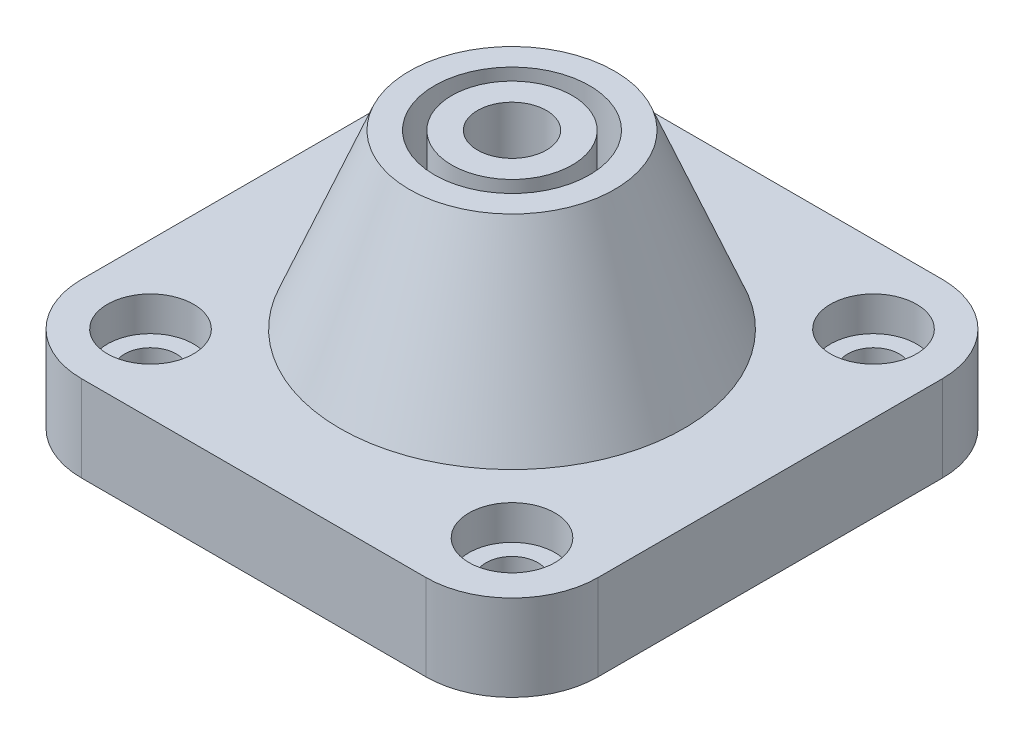
ISO-10303-21;
HEADER;
FILE_DESCRIPTION(('STEP AP214'),'2;1');
FILE_NAME('part.step','',(''),(''),'','','');
FILE_SCHEMA(('AUTOMOTIVE_DESIGN { 1 0 10303 214 1 1 1 1 }'));
ENDSEC;
DATA;
#1=APPLICATION_CONTEXT('core data for automotive mechanical design processes');
#2=APPLICATION_PROTOCOL_DEFINITION('international standard','automotive_design',2000,#1);
#3=PRODUCT_CONTEXT('',#1,'mechanical');
#4=PRODUCT('Part','Part','',(#3));
#5=PRODUCT_RELATED_PRODUCT_CATEGORY('part','',(#4));
#6=PRODUCT_DEFINITION_FORMATION('','',#4);
#7=PRODUCT_DEFINITION_CONTEXT('part definition',#1,'design');
#8=PRODUCT_DEFINITION('design','',#6,#7);
#9=PRODUCT_DEFINITION_SHAPE('','',#8);
#10=(LENGTH_UNIT() NAMED_UNIT(*) SI_UNIT(.MILLI.,.METRE.));
#11=(NAMED_UNIT(*) PLANE_ANGLE_UNIT() SI_UNIT($,.RADIAN.));
#12=(NAMED_UNIT(*) SI_UNIT($,.STERADIAN.) SOLID_ANGLE_UNIT());
#13=UNCERTAINTY_MEASURE_WITH_UNIT(LENGTH_MEASURE(1.E-05),#10,'distance_accuracy_value','');
#14=(GEOMETRIC_REPRESENTATION_CONTEXT(3) GLOBAL_UNCERTAINTY_ASSIGNED_CONTEXT((#13)) GLOBAL_UNIT_ASSIGNED_CONTEXT((#10,
#11,#12)) REPRESENTATION_CONTEXT('',''));
#15=CARTESIAN_POINT('',(0.,0.,0.));
#16=DIRECTION('',(0.,0.,1.));
#17=DIRECTION('',(1.,0.,0.));
#18=AXIS2_PLACEMENT_3D('',#15,#16,#17);
#19=CARTESIAN_POINT('',(10.5,0.,-10.5));
#20=DIRECTION('',(0.,1.,0.));
#21=DIRECTION('',(0.,0.,1.));
#22=AXIS2_PLACEMENT_3D('',#19,#20,#21);
#23=CYLINDRICAL_SURFACE('',#22,1.5);
#24=CARTESIAN_POINT('',(10.5,0.,-10.5));
#25=DIRECTION('',(0.,1.,0.));
#26=DIRECTION('',(0.,0.,1.));
#27=AXIS2_PLACEMENT_3D('',#24,#25,#26);
#28=CIRCLE('',#27,1.5);
#29=CARTESIAN_POINT('',(10.5,0.,-8.99999999999995));
#30=VERTEX_POINT('',#29);
#31=EDGE_CURVE('E306',#30,#30,#28,.T.);
#32=ORIENTED_EDGE('',*,*,#31,.F.);
#33=EDGE_LOOP('',(#32));
#34=FACE_BOUND('',#33,.T.);
#35=CARTESIAN_POINT('',(10.5,3.,-10.5));
#36=DIRECTION('',(0.,1.,0.));
#37=DIRECTION('',(0.,0.,1.));
#38=AXIS2_PLACEMENT_3D('',#35,#36,#37);
#39=CIRCLE('',#38,1.5);
#40=CARTESIAN_POINT('',(10.5,3.,-8.99999999999995));
#41=VERTEX_POINT('',#40);
#42=EDGE_CURVE('E155',#41,#41,#39,.F.);
#43=ORIENTED_EDGE('',*,*,#42,.F.);
#44=EDGE_LOOP('',(#43));
#45=FACE_BOUND('',#44,.T.);
#46=ADVANCED_FACE('F36',(#34,#45),#23,.F.);
#47=CARTESIAN_POINT('',(10.5,0.,10.5));
#48=DIRECTION('',(0.,1.,0.));
#49=DIRECTION('',(0.,0.,1.));
#50=AXIS2_PLACEMENT_3D('',#47,#48,#49);
#51=CYLINDRICAL_SURFACE('',#50,1.5);
#52=CARTESIAN_POINT('',(10.5,0.,10.5));
#53=DIRECTION('',(0.,1.,0.));
#54=DIRECTION('',(0.,0.,1.));
#55=AXIS2_PLACEMENT_3D('',#52,#53,#54);
#56=CIRCLE('',#55,1.5);
#57=CARTESIAN_POINT('',(10.5,0.,12.));
#58=VERTEX_POINT('',#57);
#59=EDGE_CURVE('E310',#58,#58,#56,.T.);
#60=ORIENTED_EDGE('',*,*,#59,.F.);
#61=EDGE_LOOP('',(#60));
#62=FACE_BOUND('',#61,.T.);
#63=CARTESIAN_POINT('',(10.5,3.,10.5));
#64=DIRECTION('',(0.,1.,0.));
#65=DIRECTION('',(0.,0.,1.));
#66=AXIS2_PLACEMENT_3D('',#63,#64,#65);
#67=CIRCLE('',#66,1.5);
#68=CARTESIAN_POINT('',(10.5,3.,12.));
#69=VERTEX_POINT('',#68);
#70=EDGE_CURVE('E152',#69,#69,#67,.F.);
#71=ORIENTED_EDGE('',*,*,#70,.F.);
#72=EDGE_LOOP('',(#71));
#73=FACE_BOUND('',#72,.T.);
#74=ADVANCED_FACE('F197',(#62,#73),#51,.F.);
#75=CARTESIAN_POINT('',(-10.5,0.,10.5));
#76=DIRECTION('',(0.,1.,0.));
#77=DIRECTION('',(0.,0.,1.));
#78=AXIS2_PLACEMENT_3D('',#75,#76,#77);
#79=CYLINDRICAL_SURFACE('',#78,1.5);
#80=CARTESIAN_POINT('',(-10.5,0.,10.5));
#81=DIRECTION('',(0.,1.,0.));
#82=DIRECTION('',(0.,0.,1.));
#83=AXIS2_PLACEMENT_3D('',#80,#81,#82);
#84=CIRCLE('',#83,1.5);
#85=CARTESIAN_POINT('',(-10.5,0.,12.));
#86=VERTEX_POINT('',#85);
#87=EDGE_CURVE('E313',#86,#86,#84,.T.);
#88=ORIENTED_EDGE('',*,*,#87,.F.);
#89=EDGE_LOOP('',(#88));
#90=FACE_BOUND('',#89,.T.);
#91=CARTESIAN_POINT('',(-10.5,3.,10.5));
#92=DIRECTION('',(0.,1.,0.));
#93=DIRECTION('',(0.,0.,1.));
#94=AXIS2_PLACEMENT_3D('',#91,#92,#93);
#95=CIRCLE('',#94,1.5);
#96=CARTESIAN_POINT('',(-10.5,3.,12.));
#97=VERTEX_POINT('',#96);
#98=EDGE_CURVE('E148',#97,#97,#95,.F.);
#99=ORIENTED_EDGE('',*,*,#98,.F.);
#100=EDGE_LOOP('',(#99));
#101=FACE_BOUND('',#100,.T.);
#102=ADVANCED_FACE('F203',(#90,#101),#79,.F.);
#103=CARTESIAN_POINT('',(-10.5,0.,-10.5));
#104=DIRECTION('',(0.,1.,0.));
#105=DIRECTION('',(0.,0.,1.));
#106=AXIS2_PLACEMENT_3D('',#103,#104,#105);
#107=CYLINDRICAL_SURFACE('',#106,1.5);
#108=CARTESIAN_POINT('',(-10.5,0.,-10.5));
#109=DIRECTION('',(0.,1.,0.));
#110=DIRECTION('',(0.,0.,1.));
#111=AXIS2_PLACEMENT_3D('',#108,#109,#110);
#112=CIRCLE('',#111,1.5);
#113=CARTESIAN_POINT('',(-10.5,0.,-8.99999999999995));
#114=VERTEX_POINT('',#113);
#115=EDGE_CURVE('E158',#114,#114,#112,.T.);
#116=ORIENTED_EDGE('',*,*,#115,.F.);
#117=EDGE_LOOP('',(#116));
#118=FACE_BOUND('',#117,.T.);
#119=CARTESIAN_POINT('',(-10.5,3.,-10.5));
#120=DIRECTION('',(0.,1.,0.));
#121=DIRECTION('',(0.,0.,1.));
#122=AXIS2_PLACEMENT_3D('',#119,#120,#121);
#123=CIRCLE('',#122,1.5);
#124=CARTESIAN_POINT('',(-10.5,3.,-8.99999999999995));
#125=VERTEX_POINT('',#124);
#126=EDGE_CURVE('E145',#125,#125,#123,.F.);
#127=ORIENTED_EDGE('',*,*,#126,.F.);
#128=EDGE_LOOP('',(#127));
#129=FACE_BOUND('',#128,.T.);
#130=ADVANCED_FACE('F210',(#118,#129),#107,.F.);
#131=CARTESIAN_POINT('',(0.,15.,0.));
#132=DIRECTION('',(0.,1.,0.));
#133=DIRECTION('',(0.,0.,1.));
#134=AXIS2_PLACEMENT_3D('',#131,#132,#133);
#135=PLANE('',#134);
#136=CARTESIAN_POINT('',(0.,15.,0.));
#137=DIRECTION('',(0.,1.,0.));
#138=DIRECTION('',(0.,0.,1.));
#139=AXIS2_PLACEMENT_3D('',#136,#137,#138);
#140=CIRCLE('',#139,2.);
#141=CARTESIAN_POINT('',(0.,15.,2.));
#142=VERTEX_POINT('',#141);
#143=EDGE_CURVE('E137',#142,#142,#140,.T.);
#144=ORIENTED_EDGE('',*,*,#143,.F.);
#145=EDGE_LOOP('',(#144));
#146=FACE_BOUND('',#145,.T.);
#147=CARTESIAN_POINT('',(0.,15.,0.));
#148=DIRECTION('',(0.,1.,0.));
#149=DIRECTION('',(0.,0.,1.));
#150=AXIS2_PLACEMENT_3D('',#147,#148,#149);
#151=CIRCLE('',#150,3.5);
#152=CARTESIAN_POINT('',(0.,15.,3.5));
#153=VERTEX_POINT('',#152);
#154=EDGE_CURVE('E302',#153,#153,#151,.T.);
#155=ORIENTED_EDGE('',*,*,#154,.T.);
#156=EDGE_LOOP('',(#155));
#157=FACE_BOUND('',#156,.T.);
#158=ADVANCED_FACE('F233',(#146,#157),#135,.T.);
#159=CARTESIAN_POINT('',(15.,5.,15.));
#160=DIRECTION('',(-1.,0.,0.));
#161=DIRECTION('',(0.,0.,1.));
#162=AXIS2_PLACEMENT_3D('',#159,#160,#161);
#163=PLANE('',#162);
#164=DIRECTION('',(0.,0.,-1.));
#165=VECTOR('',#164,1.);
#166=CARTESIAN_POINT('',(15.,0.,15.));
#167=LINE('',#166,#165);
#168=CARTESIAN_POINT('',(15.,0.,10.));
#169=VERTEX_POINT('',#168);
#170=CARTESIAN_POINT('',(15.,0.,-10.));
#171=VERTEX_POINT('',#170);
#172=EDGE_CURVE('E133',#169,#171,#167,.T.);
#173=ORIENTED_EDGE('',*,*,#172,.T.);
#174=DIRECTION('',(0.,-1.,0.));
#175=VECTOR('',#174,1.);
#176=CARTESIAN_POINT('',(15.,5.,-10.));
#177=LINE('',#176,#175);
#178=CARTESIAN_POINT('',(15.,5.,-10.));
#179=VERTEX_POINT('',#178);
#180=EDGE_CURVE('E177',#171,#179,#177,.F.);
#181=ORIENTED_EDGE('',*,*,#180,.T.);
#182=DIRECTION('',(0.,0.,-1.));
#183=VECTOR('',#182,1.);
#184=CARTESIAN_POINT('',(15.,5.,15.));
#185=LINE('',#184,#183);
#186=CARTESIAN_POINT('',(15.,5.,10.));
#187=VERTEX_POINT('',#186);
#188=EDGE_CURVE('E131',#187,#179,#185,.T.);
#189=ORIENTED_EDGE('',*,*,#188,.F.);
#190=DIRECTION('',(0.,-1.,0.));
#191=VECTOR('',#190,1.);
#192=CARTESIAN_POINT('',(15.,5.,10.));
#193=LINE('',#192,#191);
#194=EDGE_CURVE('E174',#187,#169,#193,.T.);
#195=ORIENTED_EDGE('',*,*,#194,.T.);
#196=EDGE_LOOP('',(#173,#181,#189,#195));
#197=FACE_BOUND('',#196,.T.);
#198=ADVANCED_FACE('F248',(#197),#163,.F.);
#199=CARTESIAN_POINT('',(-15.,5.,-15.));
#200=DIRECTION('',(0.,0.,1.));
#201=DIRECTION('',(1.,0.,0.));
#202=AXIS2_PLACEMENT_3D('',#199,#200,#201);
#203=PLANE('',#202);
#204=DIRECTION('',(-1.,0.,0.));
#205=VECTOR('',#204,1.);
#206=CARTESIAN_POINT('',(-15.,0.,-15.));
#207=LINE('',#206,#205);
#208=CARTESIAN_POINT('',(10.,0.,-15.));
#209=VERTEX_POINT('',#208);
#210=CARTESIAN_POINT('',(-10.,0.,-15.));
#211=VERTEX_POINT('',#210);
#212=EDGE_CURVE('E129',#209,#211,#207,.T.);
#213=ORIENTED_EDGE('',*,*,#212,.T.);
#214=DIRECTION('',(0.,-1.,0.));
#215=VECTOR('',#214,1.);
#216=CARTESIAN_POINT('',(-10.,5.,-15.));
#217=LINE('',#216,#215);
#218=CARTESIAN_POINT('',(-10.,5.,-15.));
#219=VERTEX_POINT('',#218);
#220=EDGE_CURVE('E108',#211,#219,#217,.F.);
#221=ORIENTED_EDGE('',*,*,#220,.T.);
#222=DIRECTION('',(-1.,0.,0.));
#223=VECTOR('',#222,1.);
#224=CARTESIAN_POINT('',(-15.,5.,-15.));
#225=LINE('',#224,#223);
#226=CARTESIAN_POINT('',(10.,5.,-15.));
#227=VERTEX_POINT('',#226);
#228=EDGE_CURVE('E278',#227,#219,#225,.T.);
#229=ORIENTED_EDGE('',*,*,#228,.F.);
#230=DIRECTION('',(0.,-1.,0.));
#231=VECTOR('',#230,1.);
#232=CARTESIAN_POINT('',(10.,5.,-15.));
#233=LINE('',#232,#231);
#234=EDGE_CURVE('E113',#227,#209,#233,.T.);
#235=ORIENTED_EDGE('',*,*,#234,.T.);
#236=EDGE_LOOP('',(#213,#221,#229,#235));
#237=FACE_BOUND('',#236,.T.);
#238=ADVANCED_FACE('F245',(#237),#203,.F.);
#239=CARTESIAN_POINT('',(-15.,5.,15.));
#240=DIRECTION('',(1.,0.,0.));
#241=DIRECTION('',(0.,0.,-1.));
#242=AXIS2_PLACEMENT_3D('',#239,#240,#241);
#243=PLANE('',#242);
#244=DIRECTION('',(0.,0.,1.));
#245=VECTOR('',#244,1.);
#246=CARTESIAN_POINT('',(-15.,5.,15.));
#247=LINE('',#246,#245);
#248=CARTESIAN_POINT('',(-15.,5.,-10.));
#249=VERTEX_POINT('',#248);
#250=CARTESIAN_POINT('',(-15.,5.,10.));
#251=VERTEX_POINT('',#250);
#252=EDGE_CURVE('E122',#249,#251,#247,.T.);
#253=ORIENTED_EDGE('',*,*,#252,.F.);
#254=DIRECTION('',(0.,-1.,0.));
#255=VECTOR('',#254,1.);
#256=CARTESIAN_POINT('',(-15.,5.,-10.));
#257=LINE('',#256,#255);
#258=CARTESIAN_POINT('',(-15.,0.,-10.));
#259=VERTEX_POINT('',#258);
#260=EDGE_CURVE('E107',#249,#259,#257,.T.);
#261=ORIENTED_EDGE('',*,*,#260,.T.);
#262=DIRECTION('',(0.,0.,1.));
#263=VECTOR('',#262,1.);
#264=CARTESIAN_POINT('',(-15.,0.,15.));
#265=LINE('',#264,#263);
#266=CARTESIAN_POINT('',(-15.,0.,10.));
#267=VERTEX_POINT('',#266);
#268=EDGE_CURVE('E120',#259,#267,#265,.T.);
#269=ORIENTED_EDGE('',*,*,#268,.T.);
#270=DIRECTION('',(0.,-1.,0.));
#271=VECTOR('',#270,1.);
#272=CARTESIAN_POINT('',(-15.,5.,10.));
#273=LINE('',#272,#271);
#274=EDGE_CURVE('E124',#267,#251,#273,.F.);
#275=ORIENTED_EDGE('',*,*,#274,.T.);
#276=EDGE_LOOP('',(#253,#261,#269,#275));
#277=FACE_BOUND('',#276,.T.);
#278=ADVANCED_FACE('F119',(#277),#243,.F.);
#279=CARTESIAN_POINT('',(-15.,5.,15.));
#280=DIRECTION('',(0.,0.,-1.));
#281=DIRECTION('',(-1.,0.,0.));
#282=AXIS2_PLACEMENT_3D('',#279,#280,#281);
#283=PLANE('',#282);
#284=DIRECTION('',(1.,0.,0.));
#285=VECTOR('',#284,1.);
#286=CARTESIAN_POINT('',(-15.,0.,15.));
#287=LINE('',#286,#285);
#288=CARTESIAN_POINT('',(-10.,0.,15.));
#289=VERTEX_POINT('',#288);
#290=CARTESIAN_POINT('',(10.,0.,15.));
#291=VERTEX_POINT('',#290);
#292=EDGE_CURVE('E128',#289,#291,#287,.T.);
#293=ORIENTED_EDGE('',*,*,#292,.T.);
#294=DIRECTION('',(0.,-1.,0.));
#295=VECTOR('',#294,1.);
#296=CARTESIAN_POINT('',(10.,5.,15.));
#297=LINE('',#296,#295);
#298=CARTESIAN_POINT('',(10.,5.,15.));
#299=VERTEX_POINT('',#298);
#300=EDGE_CURVE('E51',#291,#299,#297,.F.);
#301=ORIENTED_EDGE('',*,*,#300,.T.);
#302=DIRECTION('',(1.,0.,0.));
#303=VECTOR('',#302,1.);
#304=CARTESIAN_POINT('',(-15.,5.,15.));
#305=LINE('',#304,#303);
#306=CARTESIAN_POINT('',(-10.,5.,15.));
#307=VERTEX_POINT('',#306);
#308=EDGE_CURVE('E274',#307,#299,#305,.T.);
#309=ORIENTED_EDGE('',*,*,#308,.F.);
#310=DIRECTION('',(0.,-1.,0.));
#311=VECTOR('',#310,1.);
#312=CARTESIAN_POINT('',(-10.,5.,15.));
#313=LINE('',#312,#311);
#314=EDGE_CURVE('E179',#307,#289,#313,.T.);
#315=ORIENTED_EDGE('',*,*,#314,.T.);
#316=EDGE_LOOP('',(#293,#301,#309,#315));
#317=FACE_BOUND('',#316,.T.);
#318=ADVANCED_FACE('F237',(#317),#283,.F.);
#319=CARTESIAN_POINT('',(0.,5.,0.));
#320=DIRECTION('',(0.,-1.,0.));
#321=DIRECTION('',(0.,0.,-1.));
#322=AXIS2_PLACEMENT_3D('',#319,#320,#321);
#323=PLANE('',#322);
#324=CARTESIAN_POINT('',(-10.5,5.,10.5));
#325=DIRECTION('',(0.,1.,0.));
#326=DIRECTION('',(0.,0.,1.));
#327=AXIS2_PLACEMENT_3D('',#324,#325,#326);
#328=CIRCLE('',#327,2.5);
#329=CARTESIAN_POINT('',(-10.5,5.,13.));
#330=VERTEX_POINT('',#329);
#331=EDGE_CURVE('E324',#330,#330,#328,.T.);
#332=ORIENTED_EDGE('',*,*,#331,.F.);
#333=EDGE_LOOP('',(#332));
#334=FACE_BOUND('',#333,.T.);
#335=CARTESIAN_POINT('',(10.5,5.,10.5));
#336=DIRECTION('',(0.,1.,0.));
#337=DIRECTION('',(0.,0.,1.));
#338=AXIS2_PLACEMENT_3D('',#335,#336,#337);
#339=CIRCLE('',#338,2.5);
#340=CARTESIAN_POINT('',(10.5,5.,13.));
#341=VERTEX_POINT('',#340);
#342=EDGE_CURVE('E330',#341,#341,#339,.T.);
#343=ORIENTED_EDGE('',*,*,#342,.F.);
#344=EDGE_LOOP('',(#343));
#345=FACE_BOUND('',#344,.T.);
#346=CARTESIAN_POINT('',(10.5,5.,-10.5));
#347=DIRECTION('',(0.,1.,0.));
#348=DIRECTION('',(0.,0.,1.));
#349=AXIS2_PLACEMENT_3D('',#346,#347,#348);
#350=CIRCLE('',#349,2.5);
#351=CARTESIAN_POINT('',(10.5,5.,-7.99999999999995));
#352=VERTEX_POINT('',#351);
#353=EDGE_CURVE('E336',#352,#352,#350,.T.);
#354=ORIENTED_EDGE('',*,*,#353,.F.);
#355=EDGE_LOOP('',(#354));
#356=FACE_BOUND('',#355,.T.);
#357=CARTESIAN_POINT('',(-10.5,5.,-10.5));
#358=DIRECTION('',(0.,1.,0.));
#359=DIRECTION('',(0.,0.,1.));
#360=AXIS2_PLACEMENT_3D('',#357,#358,#359);
#361=CIRCLE('',#360,2.5);
#362=CARTESIAN_POINT('',(-10.5,5.,-7.99999999999995));
#363=VERTEX_POINT('',#362);
#364=EDGE_CURVE('E318',#363,#363,#361,.T.);
#365=ORIENTED_EDGE('',*,*,#364,.F.);
#366=EDGE_LOOP('',(#365));
#367=FACE_BOUND('',#366,.T.);
#368=CARTESIAN_POINT('',(0.,5.,0.));
#369=DIRECTION('',(0.,1.,0.));
#370=DIRECTION('',(0.,0.,1.));
#371=AXIS2_PLACEMENT_3D('',#368,#369,#370);
#372=CIRCLE('',#371,10.);
#373=CARTESIAN_POINT('',(0.,5.,10.));
#374=VERTEX_POINT('',#373);
#375=EDGE_CURVE('E144',#374,#374,#372,.T.);
#376=ORIENTED_EDGE('',*,*,#375,.F.);
#377=EDGE_LOOP('',(#376));
#378=FACE_BOUND('',#377,.T.);
#379=ORIENTED_EDGE('',*,*,#228,.T.);
#380=CARTESIAN_POINT('',(-10.,5.,-10.));
#381=DIRECTION('',(0.,-1.,0.));
#382=DIRECTION('',(0.,0.,-1.));
#383=AXIS2_PLACEMENT_3D('',#380,#381,#382);
#384=CIRCLE('',#383,5.);
#385=EDGE_CURVE('E172',#219,#249,#384,.F.);
#386=ORIENTED_EDGE('',*,*,#385,.T.);
#387=ORIENTED_EDGE('',*,*,#252,.T.);
#388=CARTESIAN_POINT('',(-10.,5.,10.));
#389=DIRECTION('',(0.,-1.,0.));
#390=DIRECTION('',(0.,0.,-1.));
#391=AXIS2_PLACEMENT_3D('',#388,#389,#390);
#392=CIRCLE('',#391,5.);
#393=EDGE_CURVE('E58',#251,#307,#392,.F.);
#394=ORIENTED_EDGE('',*,*,#393,.T.);
#395=ORIENTED_EDGE('',*,*,#308,.T.);
#396=CARTESIAN_POINT('',(10.,5.,10.));
#397=DIRECTION('',(0.,-1.,0.));
#398=DIRECTION('',(0.,0.,-1.));
#399=AXIS2_PLACEMENT_3D('',#396,#397,#398);
#400=CIRCLE('',#399,5.);
#401=EDGE_CURVE('E168',#299,#187,#400,.F.);
#402=ORIENTED_EDGE('',*,*,#401,.T.);
#403=ORIENTED_EDGE('',*,*,#188,.T.);
#404=CARTESIAN_POINT('',(10.,5.,-10.));
#405=DIRECTION('',(0.,-1.,0.));
#406=DIRECTION('',(0.,0.,-1.));
#407=AXIS2_PLACEMENT_3D('',#404,#405,#406);
#408=CIRCLE('',#407,5.);
#409=EDGE_CURVE('E170',#179,#227,#408,.F.);
#410=ORIENTED_EDGE('',*,*,#409,.T.);
#411=EDGE_LOOP('',(#379,#386,#387,#394,#395,#402,#403,#410));
#412=FACE_BOUND('',#411,.T.);
#413=ADVANCED_FACE('F234',(#334,#345,#356,#367,#378,#412),#323,.F.);
#414=CARTESIAN_POINT('',(0.,0.,0.));
#415=DIRECTION('',(0.,-1.,0.));
#416=DIRECTION('',(0.,0.,-1.));
#417=AXIS2_PLACEMENT_3D('',#414,#415,#416);
#418=PLANE('',#417);
#419=CARTESIAN_POINT('',(0.,0.,0.));
#420=DIRECTION('',(0.,-1.,0.));
#421=DIRECTION('',(0.,0.,-1.));
#422=AXIS2_PLACEMENT_3D('',#419,#420,#421);
#423=CIRCLE('',#422,6.90145276746797);
#424=CARTESIAN_POINT('',(0.,0.,-6.90145276746797));
#425=VERTEX_POINT('',#424);
#426=EDGE_CURVE('E44',#425,#425,#423,.F.);
#427=ORIENTED_EDGE('',*,*,#426,.T.);
#428=EDGE_LOOP('',(#427));
#429=FACE_BOUND('',#428,.T.);
#430=ORIENTED_EDGE('',*,*,#115,.T.);
#431=EDGE_LOOP('',(#430));
#432=FACE_BOUND('',#431,.T.);
#433=ORIENTED_EDGE('',*,*,#87,.T.);
#434=EDGE_LOOP('',(#433));
#435=FACE_BOUND('',#434,.T.);
#436=ORIENTED_EDGE('',*,*,#59,.T.);
#437=EDGE_LOOP('',(#436));
#438=FACE_BOUND('',#437,.T.);
#439=ORIENTED_EDGE('',*,*,#31,.T.);
#440=EDGE_LOOP('',(#439));
#441=FACE_BOUND('',#440,.T.);
#442=ORIENTED_EDGE('',*,*,#268,.F.);
#443=CARTESIAN_POINT('',(-10.,0.,-10.));
#444=DIRECTION('',(0.,-1.,0.));
#445=DIRECTION('',(0.,0.,-1.));
#446=AXIS2_PLACEMENT_3D('',#443,#444,#445);
#447=CIRCLE('',#446,5.);
#448=EDGE_CURVE('E103',#259,#211,#447,.T.);
#449=ORIENTED_EDGE('',*,*,#448,.T.);
#450=ORIENTED_EDGE('',*,*,#212,.F.);
#451=CARTESIAN_POINT('',(10.,0.,-10.));
#452=DIRECTION('',(0.,-1.,0.));
#453=DIRECTION('',(0.,0.,-1.));
#454=AXIS2_PLACEMENT_3D('',#451,#452,#453);
#455=CIRCLE('',#454,5.);
#456=EDGE_CURVE('E114',#209,#171,#455,.T.);
#457=ORIENTED_EDGE('',*,*,#456,.T.);
#458=ORIENTED_EDGE('',*,*,#172,.F.);
#459=CARTESIAN_POINT('',(10.,0.,10.));
#460=DIRECTION('',(0.,-1.,0.));
#461=DIRECTION('',(0.,0.,-1.));
#462=AXIS2_PLACEMENT_3D('',#459,#460,#461);
#463=CIRCLE('',#462,5.);
#464=EDGE_CURVE('E161',#169,#291,#463,.T.);
#465=ORIENTED_EDGE('',*,*,#464,.T.);
#466=ORIENTED_EDGE('',*,*,#292,.F.);
#467=CARTESIAN_POINT('',(-10.,0.,10.));
#468=DIRECTION('',(0.,-1.,0.));
#469=DIRECTION('',(0.,0.,-1.));
#470=AXIS2_PLACEMENT_3D('',#467,#468,#469);
#471=CIRCLE('',#470,5.);
#472=EDGE_CURVE('E123',#289,#267,#471,.T.);
#473=ORIENTED_EDGE('',*,*,#472,.T.);
#474=EDGE_LOOP('',(#442,#449,#450,#457,#458,#465,#466,#473));
#475=FACE_BOUND('',#474,.T.);
#476=ADVANCED_FACE('F126',(#429,#432,#435,#438,#441,#475),#418,.T.);
#477=CARTESIAN_POINT('',(0.,15.,0.));
#478=DIRECTION('',(0.,1.,0.));
#479=DIRECTION('',(0.,0.,1.));
#480=AXIS2_PLACEMENT_3D('',#477,#478,#479);
#481=CIRCLE('',#480,5.95973774164842);
#482=CARTESIAN_POINT('',(0.,15.,5.95973774164842));
#483=VERTEX_POINT('',#482);
#484=EDGE_CURVE('E141',#483,#483,#481,.T.);
#485=ORIENTED_EDGE('',*,*,#484,.T.);
#486=EDGE_LOOP('',(#485));
#487=FACE_BOUND('',#486,.T.);
#488=CARTESIAN_POINT('',(0.,15.,0.));
#489=DIRECTION('',(0.,1.,0.));
#490=DIRECTION('',(0.,0.,1.));
#491=AXIS2_PLACEMENT_3D('',#488,#489,#490);
#492=CIRCLE('',#491,4.5);
#493=CARTESIAN_POINT('',(0.,15.,4.5));
#494=VERTEX_POINT('',#493);
#495=EDGE_CURVE('E296',#494,#494,#492,.T.);
#496=ORIENTED_EDGE('',*,*,#495,.F.);
#497=EDGE_LOOP('',(#496));
#498=FACE_BOUND('',#497,.T.);
#499=ADVANCED_FACE('F228',(#487,#498),#135,.T.);
#500=CARTESIAN_POINT('',(0.,0.,0.));
#501=DIRECTION('',(0.,1.,0.));
#502=DIRECTION('',(0.,0.,1.));
#503=AXIS2_PLACEMENT_3D('',#500,#501,#502);
#504=CYLINDRICAL_SURFACE('',#503,2.);
#505=CARTESIAN_POINT('',(0.,7.00000000000003,0.));
#506=DIRECTION('',(0.,-1.,0.));
#507=DIRECTION('',(0.,0.,-1.));
#508=AXIS2_PLACEMENT_3D('',#505,#506,#507);
#509=CIRCLE('',#508,2.);
#510=CARTESIAN_POINT('',(0.,7.00000000000003,-2.));
#511=VERTEX_POINT('',#510);
#512=EDGE_CURVE('E11',#511,#511,#509,.T.);
#513=ORIENTED_EDGE('',*,*,#512,.T.);
#514=EDGE_LOOP('',(#513));
#515=FACE_BOUND('',#514,.T.);
#516=ORIENTED_EDGE('',*,*,#143,.T.);
#517=EDGE_LOOP('',(#516));
#518=FACE_BOUND('',#517,.T.);
#519=ADVANCED_FACE('F224',(#515,#518),#504,.F.);
#520=CARTESIAN_POINT('',(0.,8.,0.));
#521=DIRECTION('',(0.,1.,0.));
#522=DIRECTION('',(0.,0.,1.));
#523=AXIS2_PLACEMENT_3D('',#520,#521,#522);
#524=CYLINDRICAL_SURFACE('',#523,4.5);
#525=CARTESIAN_POINT('',(0.,8.,0.));
#526=DIRECTION('',(0.,1.,0.));
#527=DIRECTION('',(0.,0.,1.));
#528=AXIS2_PLACEMENT_3D('',#525,#526,#527);
#529=CIRCLE('',#528,4.5);
#530=CARTESIAN_POINT('',(0.,8.,4.5));
#531=VERTEX_POINT('',#530);
#532=EDGE_CURVE('E140',#531,#531,#529,.T.);
#533=ORIENTED_EDGE('',*,*,#532,.F.);
#534=EDGE_LOOP('',(#533));
#535=FACE_BOUND('',#534,.T.);
#536=ORIENTED_EDGE('',*,*,#495,.T.);
#537=EDGE_LOOP('',(#536));
#538=FACE_BOUND('',#537,.T.);
#539=ADVANCED_FACE('F220',(#535,#538),#524,.F.);
#540=CARTESIAN_POINT('',(0.,8.,0.));
#541=DIRECTION('',(0.,1.,0.));
#542=DIRECTION('',(0.,0.,1.));
#543=AXIS2_PLACEMENT_3D('',#540,#541,#542);
#544=PLANE('',#543);
#545=CARTESIAN_POINT('',(0.,8.,0.));
#546=DIRECTION('',(0.,1.,0.));
#547=DIRECTION('',(0.,0.,1.));
#548=AXIS2_PLACEMENT_3D('',#545,#546,#547);
#549=CIRCLE('',#548,3.5);
#550=CARTESIAN_POINT('',(0.,8.,3.5));
#551=VERTEX_POINT('',#550);
#552=EDGE_CURVE('E298',#551,#551,#549,.T.);
#553=ORIENTED_EDGE('',*,*,#552,.F.);
#554=EDGE_LOOP('',(#553));
#555=FACE_BOUND('',#554,.T.);
#556=ORIENTED_EDGE('',*,*,#532,.T.);
#557=EDGE_LOOP('',(#556));
#558=FACE_BOUND('',#557,.T.);
#559=ADVANCED_FACE('F216',(#555,#558),#544,.T.);
#560=CARTESIAN_POINT('',(0.,8.,0.));
#561=DIRECTION('',(0.,1.,0.));
#562=DIRECTION('',(0.,0.,1.));
#563=AXIS2_PLACEMENT_3D('',#560,#561,#562);
#564=CYLINDRICAL_SURFACE('',#563,3.5);
#565=ORIENTED_EDGE('',*,*,#552,.T.);
#566=EDGE_LOOP('',(#565));
#567=FACE_BOUND('',#566,.T.);
#568=ORIENTED_EDGE('',*,*,#154,.F.);
#569=EDGE_LOOP('',(#568));
#570=FACE_BOUND('',#569,.T.);
#571=ADVANCED_FACE('F212',(#567,#570),#564,.T.);
#572=CARTESIAN_POINT('',(0.,15.,0.));
#573=DIRECTION('',(0.,-1.,0.));
#574=DIRECTION('',(0.,0.,-1.));
#575=AXIS2_PLACEMENT_3D('',#572,#573,#574);
#576=CONICAL_SURFACE('',#575,5.95973774164842,0.38397243543875);
#577=ORIENTED_EDGE('',*,*,#375,.T.);
#578=EDGE_LOOP('',(#577));
#579=FACE_BOUND('',#578,.T.);
#580=ORIENTED_EDGE('',*,*,#484,.F.);
#581=EDGE_LOOP('',(#580));
#582=FACE_BOUND('',#581,.T.);
#583=ADVANCED_FACE('F215',(#579,#582),#576,.T.);
#584=CARTESIAN_POINT('',(-10.5,3.,-10.5));
#585=DIRECTION('',(0.,1.,0.));
#586=DIRECTION('',(0.,0.,1.));
#587=AXIS2_PLACEMENT_3D('',#584,#585,#586);
#588=PLANE('',#587);
#589=CARTESIAN_POINT('',(-10.5,3.,-10.5));
#590=DIRECTION('',(0.,1.,0.));
#591=DIRECTION('',(0.,0.,1.));
#592=AXIS2_PLACEMENT_3D('',#589,#590,#591);
#593=CIRCLE('',#592,2.5);
#594=CARTESIAN_POINT('',(-10.5,3.,-7.99999999999995));
#595=VERTEX_POINT('',#594);
#596=EDGE_CURVE('E149',#595,#595,#593,.T.);
#597=ORIENTED_EDGE('',*,*,#596,.T.);
#598=EDGE_LOOP('',(#597));
#599=FACE_BOUND('',#598,.T.);
#600=ORIENTED_EDGE('',*,*,#126,.T.);
#601=EDGE_LOOP('',(#600));
#602=FACE_BOUND('',#601,.T.);
#603=ADVANCED_FACE('F255',(#599,#602),#588,.T.);
#604=CARTESIAN_POINT('',(-10.5,3.,-10.5));
#605=DIRECTION('',(0.,1.,0.));
#606=DIRECTION('',(0.,0.,1.));
#607=AXIS2_PLACEMENT_3D('',#604,#605,#606);
#608=CYLINDRICAL_SURFACE('',#607,2.5);
#609=ORIENTED_EDGE('',*,*,#596,.F.);
#610=EDGE_LOOP('',(#609));
#611=FACE_BOUND('',#610,.T.);
#612=ORIENTED_EDGE('',*,*,#364,.T.);
#613=EDGE_LOOP('',(#612));
#614=FACE_BOUND('',#613,.T.);
#615=ADVANCED_FACE('F353',(#611,#614),#608,.F.);
#616=CARTESIAN_POINT('',(-10.5,3.,10.5));
#617=DIRECTION('',(0.,1.,0.));
#618=DIRECTION('',(0.,0.,1.));
#619=AXIS2_PLACEMENT_3D('',#616,#617,#618);
#620=PLANE('',#619);
#621=CARTESIAN_POINT('',(-10.5,3.,10.5));
#622=DIRECTION('',(0.,1.,0.));
#623=DIRECTION('',(0.,0.,1.));
#624=AXIS2_PLACEMENT_3D('',#621,#622,#623);
#625=CIRCLE('',#624,2.5);
#626=CARTESIAN_POINT('',(-10.5,3.,13.));
#627=VERTEX_POINT('',#626);
#628=EDGE_CURVE('E327',#627,#627,#625,.T.);
#629=ORIENTED_EDGE('',*,*,#628,.T.);
#630=EDGE_LOOP('',(#629));
#631=FACE_BOUND('',#630,.T.);
#632=ORIENTED_EDGE('',*,*,#98,.T.);
#633=EDGE_LOOP('',(#632));
#634=FACE_BOUND('',#633,.T.);
#635=ADVANCED_FACE('F355',(#631,#634),#620,.T.);
#636=CARTESIAN_POINT('',(-10.5,3.,10.5));
#637=DIRECTION('',(0.,1.,0.));
#638=DIRECTION('',(0.,0.,1.));
#639=AXIS2_PLACEMENT_3D('',#636,#637,#638);
#640=CYLINDRICAL_SURFACE('',#639,2.5);
#641=ORIENTED_EDGE('',*,*,#628,.F.);
#642=EDGE_LOOP('',(#641));
#643=FACE_BOUND('',#642,.T.);
#644=ORIENTED_EDGE('',*,*,#331,.T.);
#645=EDGE_LOOP('',(#644));
#646=FACE_BOUND('',#645,.T.);
#647=ADVANCED_FACE('F362',(#643,#646),#640,.F.);
#648=CARTESIAN_POINT('',(10.5,3.,10.5));
#649=DIRECTION('',(0.,1.,0.));
#650=DIRECTION('',(0.,0.,1.));
#651=AXIS2_PLACEMENT_3D('',#648,#649,#650);
#652=PLANE('',#651);
#653=CARTESIAN_POINT('',(10.5,3.,10.5));
#654=DIRECTION('',(0.,1.,0.));
#655=DIRECTION('',(0.,0.,1.));
#656=AXIS2_PLACEMENT_3D('',#653,#654,#655);
#657=CIRCLE('',#656,2.5);
#658=CARTESIAN_POINT('',(10.5,3.,13.));
#659=VERTEX_POINT('',#658);
#660=EDGE_CURVE('E333',#659,#659,#657,.T.);
#661=ORIENTED_EDGE('',*,*,#660,.T.);
#662=EDGE_LOOP('',(#661));
#663=FACE_BOUND('',#662,.T.);
#664=ORIENTED_EDGE('',*,*,#70,.T.);
#665=EDGE_LOOP('',(#664));
#666=FACE_BOUND('',#665,.T.);
#667=ADVANCED_FACE('F386',(#663,#666),#652,.T.);
#668=CARTESIAN_POINT('',(10.5,3.,10.5));
#669=DIRECTION('',(0.,1.,0.));
#670=DIRECTION('',(0.,0.,1.));
#671=AXIS2_PLACEMENT_3D('',#668,#669,#670);
#672=CYLINDRICAL_SURFACE('',#671,2.5);
#673=ORIENTED_EDGE('',*,*,#660,.F.);
#674=EDGE_LOOP('',(#673));
#675=FACE_BOUND('',#674,.T.);
#676=ORIENTED_EDGE('',*,*,#342,.T.);
#677=EDGE_LOOP('',(#676));
#678=FACE_BOUND('',#677,.T.);
#679=ADVANCED_FACE('F388',(#675,#678),#672,.F.);
#680=CARTESIAN_POINT('',(10.5,3.,-10.5));
#681=DIRECTION('',(0.,1.,0.));
#682=DIRECTION('',(0.,0.,1.));
#683=AXIS2_PLACEMENT_3D('',#680,#681,#682);
#684=PLANE('',#683);
#685=CARTESIAN_POINT('',(10.5,3.,-10.5));
#686=DIRECTION('',(0.,1.,0.));
#687=DIRECTION('',(0.,0.,1.));
#688=AXIS2_PLACEMENT_3D('',#685,#686,#687);
#689=CIRCLE('',#688,2.5);
#690=CARTESIAN_POINT('',(10.5,3.,-7.99999999999995));
#691=VERTEX_POINT('',#690);
#692=EDGE_CURVE('E321',#691,#691,#689,.T.);
#693=ORIENTED_EDGE('',*,*,#692,.T.);
#694=EDGE_LOOP('',(#693));
#695=FACE_BOUND('',#694,.T.);
#696=ORIENTED_EDGE('',*,*,#42,.T.);
#697=EDGE_LOOP('',(#696));
#698=FACE_BOUND('',#697,.T.);
#699=ADVANCED_FACE('F342',(#695,#698),#684,.T.);
#700=CARTESIAN_POINT('',(10.5,3.,-10.5));
#701=DIRECTION('',(0.,1.,0.));
#702=DIRECTION('',(0.,0.,1.));
#703=AXIS2_PLACEMENT_3D('',#700,#701,#702);
#704=CYLINDRICAL_SURFACE('',#703,2.5);
#705=ORIENTED_EDGE('',*,*,#692,.F.);
#706=EDGE_LOOP('',(#705));
#707=FACE_BOUND('',#706,.T.);
#708=ORIENTED_EDGE('',*,*,#353,.T.);
#709=EDGE_LOOP('',(#708));
#710=FACE_BOUND('',#709,.T.);
#711=ADVANCED_FACE('F260',(#707,#710),#704,.F.);
#712=CARTESIAN_POINT('',(-10.,5.,-10.));
#713=DIRECTION('',(0.,-1.,0.));
#714=DIRECTION('',(0.,0.,-1.));
#715=AXIS2_PLACEMENT_3D('',#712,#713,#714);
#716=CYLINDRICAL_SURFACE('',#715,5.);
#717=ORIENTED_EDGE('',*,*,#385,.F.);
#718=ORIENTED_EDGE('',*,*,#220,.F.);
#719=ORIENTED_EDGE('',*,*,#448,.F.);
#720=ORIENTED_EDGE('',*,*,#260,.F.);
#721=EDGE_LOOP('',(#717,#718,#719,#720));
#722=FACE_BOUND('',#721,.T.);
#723=ADVANCED_FACE('F106',(#722),#716,.T.);
#724=CARTESIAN_POINT('',(10.,5.,-10.));
#725=DIRECTION('',(0.,-1.,0.));
#726=DIRECTION('',(0.,0.,-1.));
#727=AXIS2_PLACEMENT_3D('',#724,#725,#726);
#728=CYLINDRICAL_SURFACE('',#727,5.);
#729=ORIENTED_EDGE('',*,*,#409,.F.);
#730=ORIENTED_EDGE('',*,*,#180,.F.);
#731=ORIENTED_EDGE('',*,*,#456,.F.);
#732=ORIENTED_EDGE('',*,*,#234,.F.);
#733=EDGE_LOOP('',(#729,#730,#731,#732));
#734=FACE_BOUND('',#733,.T.);
#735=ADVANCED_FACE('F259',(#734),#728,.T.);
#736=CARTESIAN_POINT('',(10.,5.,10.));
#737=DIRECTION('',(0.,-1.,0.));
#738=DIRECTION('',(0.,0.,-1.));
#739=AXIS2_PLACEMENT_3D('',#736,#737,#738);
#740=CYLINDRICAL_SURFACE('',#739,5.);
#741=ORIENTED_EDGE('',*,*,#401,.F.);
#742=ORIENTED_EDGE('',*,*,#300,.F.);
#743=ORIENTED_EDGE('',*,*,#464,.F.);
#744=ORIENTED_EDGE('',*,*,#194,.F.);
#745=EDGE_LOOP('',(#741,#742,#743,#744));
#746=FACE_BOUND('',#745,.T.);
#747=ADVANCED_FACE('F193',(#746),#740,.T.);
#748=CARTESIAN_POINT('',(-10.,5.,10.));
#749=DIRECTION('',(0.,-1.,0.));
#750=DIRECTION('',(0.,0.,-1.));
#751=AXIS2_PLACEMENT_3D('',#748,#749,#750);
#752=CYLINDRICAL_SURFACE('',#751,5.);
#753=ORIENTED_EDGE('',*,*,#393,.F.);
#754=ORIENTED_EDGE('',*,*,#274,.F.);
#755=ORIENTED_EDGE('',*,*,#472,.F.);
#756=ORIENTED_EDGE('',*,*,#314,.F.);
#757=EDGE_LOOP('',(#753,#754,#755,#756));
#758=FACE_BOUND('',#757,.T.);
#759=ADVANCED_FACE('F188',(#758),#752,.T.);
#760=CARTESIAN_POINT('',(0.,0.,0.));
#761=DIRECTION('',(0.,-1.,0.));
#762=DIRECTION('',(0.,0.,-1.));
#763=AXIS2_PLACEMENT_3D('',#760,#761,#762);
#764=CONICAL_SURFACE('',#763,6.90145276746797,0.610865238198013);
#765=CARTESIAN_POINT('',(0.,7.00000000000003,-2.));
#766=CARTESIAN_POINT('',(0.,6.92708333333336,-2.05105679966112));
#767=CARTESIAN_POINT('',(0.,6.8541666666667,-2.10211359932225));
#768=CARTESIAN_POINT('',(0.,6.70833333333336,-2.2042271986445));
#769=CARTESIAN_POINT('',(0.,6.63541666666669,-2.25528399830562));
#770=CARTESIAN_POINT('',(0.,6.48958333333336,-2.35739759762787));
#771=CARTESIAN_POINT('',(0.,6.41666666666669,-2.408454397289));
#772=CARTESIAN_POINT('',(0.,6.27083333333336,-2.51056799661125));
#773=CARTESIAN_POINT('',(0.,6.19791666666669,-2.56162479627237));
#774=CARTESIAN_POINT('',(0.,6.05208333333336,-2.66373839559462));
#775=CARTESIAN_POINT('',(0.,5.97916666666669,-2.71479519525574));
#776=CARTESIAN_POINT('',(0.,5.83333333333336,-2.81690879457799));
#777=CARTESIAN_POINT('',(0.,5.76041666666669,-2.86796559423912));
#778=CARTESIAN_POINT('',(0.,5.61458333333336,-2.97007919356137));
#779=CARTESIAN_POINT('',(0.,5.54166666666669,-3.02113599322249));
#780=CARTESIAN_POINT('',(0.,5.39583333333336,-3.12324959254474));
#781=CARTESIAN_POINT('',(0.,5.32291666666669,-3.17430639220587));
#782=CARTESIAN_POINT('',(0.,5.17708333333335,-3.27641999152812));
#783=CARTESIAN_POINT('',(0.,5.10416666666669,-3.32747679118924));
#784=CARTESIAN_POINT('',(0.,4.95833333333335,-3.42959039051149));
#785=CARTESIAN_POINT('',(0.,4.88541666666669,-3.48064719017261));
#786=CARTESIAN_POINT('',(0.,4.73958333333335,-3.58276078949486));
#787=CARTESIAN_POINT('',(0.,4.66666666666669,-3.63381758915599));
#788=CARTESIAN_POINT('',(0.,4.52083333333335,-3.73593118847824));
#789=CARTESIAN_POINT('',(0.,4.44791666666668,-3.78698798813936));
#790=CARTESIAN_POINT('',(0.,4.30208333333335,-3.88910158746161));
#791=CARTESIAN_POINT('',(0.,4.22916666666668,-3.94015838712274));
#792=CARTESIAN_POINT('',(0.,4.08333333333335,-4.04227198644499));
#793=CARTESIAN_POINT('',(0.,4.01041666666668,-4.09332878610611));
#794=CARTESIAN_POINT('',(0.,3.86458333333335,-4.19544238542836));
#795=CARTESIAN_POINT('',(0.,3.79166666666668,-4.24649918508948));
#796=CARTESIAN_POINT('',(0.,3.64583333333335,-4.34861278441173));
#797=CARTESIAN_POINT('',(0.,3.57291666666668,-4.39966958407286));
#798=CARTESIAN_POINT('',(0.,3.42708333333335,-4.50178318339511));
#799=CARTESIAN_POINT('',(0.,3.35416666666668,-4.55283998305623));
#800=CARTESIAN_POINT('',(0.,3.20833333333335,-4.65495358237848));
#801=CARTESIAN_POINT('',(0.,3.13541666666668,-4.70601038203961));
#802=CARTESIAN_POINT('',(0.,2.98958333333335,-4.80812398136186));
#803=CARTESIAN_POINT('',(0.,2.91666666666668,-4.85918078102298));
#804=CARTESIAN_POINT('',(0.,2.77083333333335,-4.96129438034523));
#805=CARTESIAN_POINT('',(0.,2.69791666666668,-5.01235118000635));
#806=CARTESIAN_POINT('',(0.,2.55208333333334,-5.1144647793286));
#807=CARTESIAN_POINT('',(0.,2.47916666666668,-5.16552157898973));
#808=CARTESIAN_POINT('',(0.,2.33333333333334,-5.26763517831198));
#809=CARTESIAN_POINT('',(0.,2.26041666666668,-5.3186919779731));
#810=CARTESIAN_POINT('',(0.,2.11458333333334,-5.42080557729535));
#811=CARTESIAN_POINT('',(0.,2.04166666666667,-5.47186237695648));
#812=CARTESIAN_POINT('',(0.,1.89583333333334,-5.57397597627873));
#813=CARTESIAN_POINT('',(0.,1.82291666666667,-5.62503277593985));
#814=CARTESIAN_POINT('',(0.,1.67708333333334,-5.7271463752621));
#815=CARTESIAN_POINT('',(0.,1.60416666666667,-5.77820317492322));
#816=CARTESIAN_POINT('',(0.,1.45833333333334,-5.88031677424547));
#817=CARTESIAN_POINT('',(0.,1.38541666666667,-5.9313735739066));
#818=CARTESIAN_POINT('',(0.,1.23958333333334,-6.03348717322885));
#819=CARTESIAN_POINT('',(0.,1.16666666666667,-6.08454397288997));
#820=CARTESIAN_POINT('',(0.,1.02083333333334,-6.18665757221222));
#821=CARTESIAN_POINT('',(0.,0.94791666666667,-6.23771437187335));
#822=CARTESIAN_POINT('',(0.,0.802083333333336,-6.3398279711956));
#823=CARTESIAN_POINT('',(0.,0.729166666666669,-6.39088477085672));
#824=CARTESIAN_POINT('',(0.,0.583333333333336,-6.49299837017897));
#825=CARTESIAN_POINT('',(0.,0.510416666666669,-6.54405516984009));
#826=CARTESIAN_POINT('',(0.,0.364583333333335,-6.64616876916234));
#827=CARTESIAN_POINT('',(0.,0.291666666666668,-6.69722556882347));
#828=CARTESIAN_POINT('',(0.,0.145833333333334,-6.79933916814572));
#829=CARTESIAN_POINT('',(0.,0.0729166666666668,-6.85039596780684));
#830=CARTESIAN_POINT('',(0.,0.,-6.90145276746797));
#831=B_SPLINE_CURVE_WITH_KNOTS('',3,(#765,#766,#767,#768,#769,#770,#771,#772,#773,#774,#775,
#776,#777,#778,#779,#780,#781,#782,#783,#784,#785,#786,#787,#788,#789,#790,#791,#792,#793,#794,
#795,#796,#797,#798,#799,#800,#801,#802,#803,#804,#805,#806,#807,#808,#809,#810,#811,#812,#813,
#814,#815,#816,#817,#818,#819,#820,#821,#822,#823,#824,#825,#826,#827,#828,#829,#830),
.UNSPECIFIED.,.F.,.F.,(4,2,2,2,2,2,2,2,2,2,2,2,2,2,2,2,2,2,2,2,2,2,2,2,2,2,2,2,2,2,2,2,4),(0.,
0.26704444129157,0.534088882583139,0.801133323874707,1.06817776516628,1.33522220645785,
1.60226664774942,1.86931108904099,2.13635553033255,2.40339997162412,2.67044441291569,
2.93748885420726,3.20453329549883,3.4715777367904,3.73862217808197,4.00566661937354,
4.27271106066511,4.53975550195668,4.80679994324825,5.07384438453982,5.34088882583139,
5.60793326712296,5.87497770841452,6.14202214970609,6.40906659099766,6.67611103228923,
6.9431554735808,7.21019991487237,7.47724435616394,7.74428879745551,8.01133323874708,
8.27837768003865,8.54542212133022),.UNSPECIFIED.);
#832=EDGE_CURVE('BSEAM38',#511,#425,#831,.T.);
#833=ORIENTED_EDGE('',*,*,#512,.F.);
#834=ORIENTED_EDGE('',*,*,#426,.F.);
#835=ORIENTED_EDGE('',*,*,#832,.T.);
#836=ORIENTED_EDGE('',*,*,#832,.F.);
#837=EDGE_LOOP('',(#833,#835,#834,#836));
#838=FACE_BOUND('',#837,.T.);
#839=ADVANCED_FACE('F38',(#838),#764,.F.);
#840=CLOSED_SHELL('',(#46,#74,#102,#130,#158,#198,#238,#278,#318,#413,#476,#499,#519,#539,#559,
#571,#583,#603,#615,#635,#647,#667,#679,#699,#711,#723,#735,#747,#759,#839));
#841=MANIFOLD_SOLID_BREP('B2',#840);
#842=ADVANCED_BREP_SHAPE_REPRESENTATION('',(#18,#841),#14);
#843=SHAPE_DEFINITION_REPRESENTATION(#9,#842);
ENDSEC;
END-ISO-10303-21;
